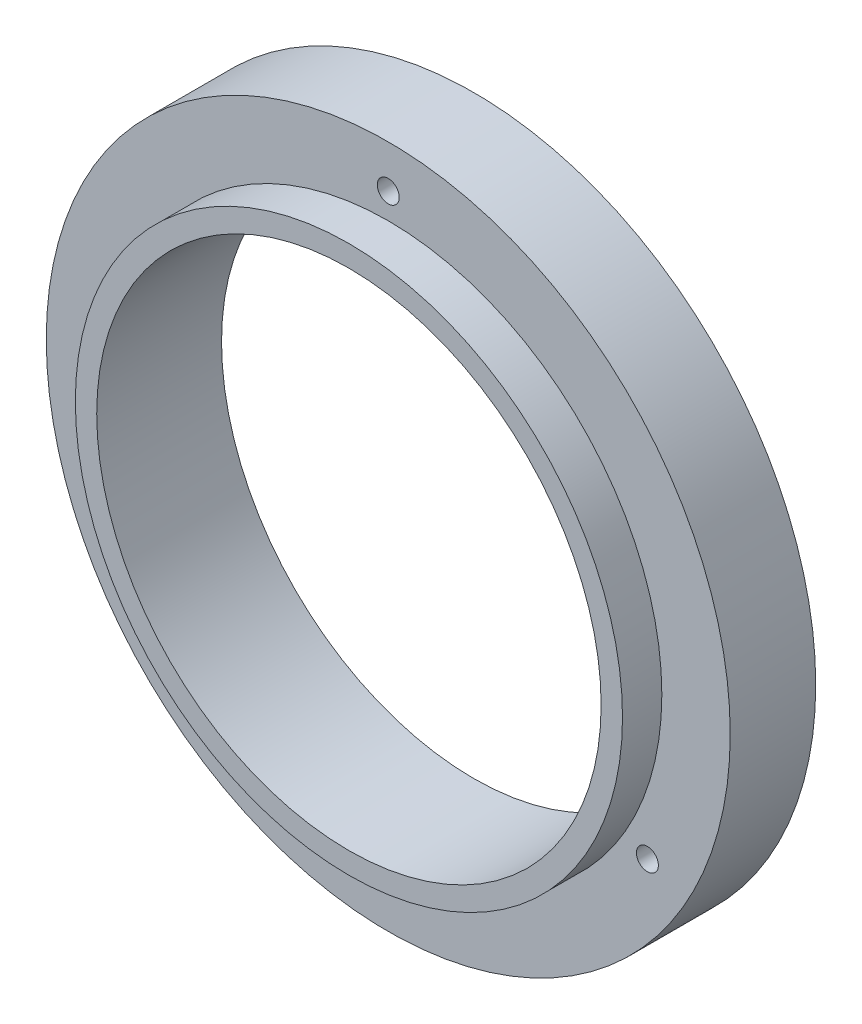
ISO-10303-21;
HEADER;
FILE_DESCRIPTION(('STEP AP214'),'2;1');
FILE_NAME('part.step','',(''),(''),'','','');
FILE_SCHEMA(('AUTOMOTIVE_DESIGN { 1 0 10303 214 1 1 1 1 }'));
ENDSEC;
DATA;
#1=APPLICATION_CONTEXT('core data for automotive mechanical design processes');
#2=APPLICATION_PROTOCOL_DEFINITION('international standard','automotive_design',2000,#1);
#3=PRODUCT_CONTEXT('',#1,'mechanical');
#4=PRODUCT('Part','Part','',(#3));
#5=PRODUCT_RELATED_PRODUCT_CATEGORY('part','',(#4));
#6=PRODUCT_DEFINITION_FORMATION('','',#4);
#7=PRODUCT_DEFINITION_CONTEXT('part definition',#1,'design');
#8=PRODUCT_DEFINITION('design','',#6,#7);
#9=PRODUCT_DEFINITION_SHAPE('','',#8);
#10=(LENGTH_UNIT() NAMED_UNIT(*) SI_UNIT(.MILLI.,.METRE.));
#11=(NAMED_UNIT(*) PLANE_ANGLE_UNIT() SI_UNIT($,.RADIAN.));
#12=(NAMED_UNIT(*) SI_UNIT($,.STERADIAN.) SOLID_ANGLE_UNIT());
#13=UNCERTAINTY_MEASURE_WITH_UNIT(LENGTH_MEASURE(1.E-05),#10,'distance_accuracy_value','');
#14=(GEOMETRIC_REPRESENTATION_CONTEXT(3) GLOBAL_UNCERTAINTY_ASSIGNED_CONTEXT((#13)) GLOBAL_UNIT_ASSIGNED_CONTEXT((#10,
#11,#12)) REPRESENTATION_CONTEXT('',''));
#15=CARTESIAN_POINT('',(0.,0.,0.));
#16=DIRECTION('',(0.,0.,1.));
#17=DIRECTION('',(1.,0.,0.));
#18=AXIS2_PLACEMENT_3D('',#15,#16,#17);
#19=CARTESIAN_POINT('',(0.,0.,12.7));
#20=DIRECTION('',(0.,0.,-1.));
#21=DIRECTION('',(-1.,0.,0.));
#22=AXIS2_PLACEMENT_3D('',#19,#20,#21);
#23=CYLINDRICAL_SURFACE('',#22,50.8);
#24=CARTESIAN_POINT('',(0.,0.,12.7));
#25=DIRECTION('',(0.,0.,1.));
#26=DIRECTION('',(1.,0.,0.));
#27=AXIS2_PLACEMENT_3D('',#24,#25,#26);
#28=CIRCLE('',#27,50.8);
#29=CARTESIAN_POINT('',(50.8,0.,12.7));
#30=VERTEX_POINT('',#29);
#31=EDGE_CURVE('E10',#30,#30,#28,.T.);
#32=ORIENTED_EDGE('',*,*,#31,.F.);
#33=EDGE_LOOP('',(#32));
#34=FACE_BOUND('',#33,.T.);
#35=CARTESIAN_POINT('',(0.,0.,0.));
#36=DIRECTION('',(0.,0.,1.));
#37=DIRECTION('',(1.,0.,0.));
#38=AXIS2_PLACEMENT_3D('',#35,#36,#37);
#39=CIRCLE('',#38,50.8);
#40=CARTESIAN_POINT('',(50.8,0.,0.));
#41=VERTEX_POINT('',#40);
#42=EDGE_CURVE('E38',#41,#41,#39,.T.);
#43=ORIENTED_EDGE('',*,*,#42,.T.);
#44=EDGE_LOOP('',(#43));
#45=FACE_BOUND('',#44,.T.);
#46=ADVANCED_FACE('F31',(#34,#45),#23,.T.);
#47=CARTESIAN_POINT('',(0.,0.,12.7));
#48=DIRECTION('',(0.,0.,1.));
#49=DIRECTION('',(1.,0.,0.));
#50=AXIS2_PLACEMENT_3D('',#47,#48,#49);
#51=PLANE('',#50);
#52=CARTESIAN_POINT('',(-38.4948291982185,-22.2249999999996,12.7));
#53=DIRECTION('',(0.,0.,1.));
#54=DIRECTION('',(1.,0.,0.));
#55=AXIS2_PLACEMENT_3D('',#52,#53,#54);
#56=CIRCLE('',#55,1.63195);
#57=CARTESIAN_POINT('',(-36.8628791982185,-22.2249999999996,12.7));
#58=VERTEX_POINT('',#57);
#59=EDGE_CURVE('E34',#58,#58,#56,.T.);
#60=ORIENTED_EDGE('',*,*,#59,.F.);
#61=EDGE_LOOP('',(#60));
#62=FACE_BOUND('',#61,.T.);
#63=CARTESIAN_POINT('',(38.4948291982182,-22.2250000000002,12.7));
#64=DIRECTION('',(0.,0.,1.));
#65=DIRECTION('',(1.,0.,0.));
#66=AXIS2_PLACEMENT_3D('',#63,#64,#65);
#67=CIRCLE('',#66,1.63195);
#68=CARTESIAN_POINT('',(40.1267791982182,-22.2250000000002,12.7));
#69=VERTEX_POINT('',#68);
#70=EDGE_CURVE('E53',#69,#69,#67,.T.);
#71=ORIENTED_EDGE('',*,*,#70,.F.);
#72=EDGE_LOOP('',(#71));
#73=FACE_BOUND('',#72,.T.);
#74=CARTESIAN_POINT('',(0.,44.45,12.7));
#75=DIRECTION('',(0.,0.,1.));
#76=DIRECTION('',(1.,0.,0.));
#77=AXIS2_PLACEMENT_3D('',#74,#75,#76);
#78=CIRCLE('',#77,1.63195);
#79=CARTESIAN_POINT('',(1.63195,44.45,12.7));
#80=VERTEX_POINT('',#79);
#81=EDGE_CURVE('E49',#80,#80,#78,.T.);
#82=ORIENTED_EDGE('',*,*,#81,.F.);
#83=EDGE_LOOP('',(#82));
#84=FACE_BOUND('',#83,.T.);
#85=CARTESIAN_POINT('',(0.,0.,12.7));
#86=DIRECTION('',(0.,0.,1.));
#87=DIRECTION('',(1.,0.,0.));
#88=AXIS2_PLACEMENT_3D('',#85,#86,#87);
#89=CIRCLE('',#88,40.64);
#90=CARTESIAN_POINT('',(40.64,0.,12.7));
#91=VERTEX_POINT('',#90);
#92=EDGE_CURVE('E46',#91,#91,#89,.T.);
#93=ORIENTED_EDGE('',*,*,#92,.F.);
#94=EDGE_LOOP('',(#93));
#95=FACE_BOUND('',#94,.T.);
#96=ORIENTED_EDGE('',*,*,#31,.T.);
#97=EDGE_LOOP('',(#96));
#98=FACE_BOUND('',#97,.T.);
#99=ADVANCED_FACE('F88',(#62,#73,#84,#95,#98),#51,.T.);
#100=CARTESIAN_POINT('',(0.,0.,0.));
#101=DIRECTION('',(0.,0.,1.));
#102=DIRECTION('',(1.,0.,0.));
#103=AXIS2_PLACEMENT_3D('',#100,#101,#102);
#104=PLANE('',#103);
#105=CARTESIAN_POINT('',(-38.4948291982185,-22.2249999999996,0.));
#106=DIRECTION('',(0.,0.,-1.));
#107=DIRECTION('',(-1.,0.,0.));
#108=AXIS2_PLACEMENT_3D('',#105,#106,#107);
#109=CIRCLE('',#108,2.77876);
#110=CARTESIAN_POINT('',(-41.2735891982185,-22.2249999999996,0.));
#111=VERTEX_POINT('',#110);
#112=EDGE_CURVE('E154',#111,#111,#109,.T.);
#113=ORIENTED_EDGE('',*,*,#112,.F.);
#114=EDGE_LOOP('',(#113));
#115=FACE_BOUND('',#114,.T.);
#116=CARTESIAN_POINT('',(38.4948291982182,-22.2250000000002,0.));
#117=DIRECTION('',(0.,0.,-1.));
#118=DIRECTION('',(-1.,0.,0.));
#119=AXIS2_PLACEMENT_3D('',#116,#117,#118);
#120=CIRCLE('',#119,2.77876);
#121=CARTESIAN_POINT('',(35.7160691982182,-22.2250000000002,0.));
#122=VERTEX_POINT('',#121);
#123=EDGE_CURVE('E68',#122,#122,#120,.T.);
#124=ORIENTED_EDGE('',*,*,#123,.F.);
#125=EDGE_LOOP('',(#124));
#126=FACE_BOUND('',#125,.T.);
#127=CARTESIAN_POINT('',(0.,44.45,0.));
#128=DIRECTION('',(0.,0.,-1.));
#129=DIRECTION('',(-1.,0.,0.));
#130=AXIS2_PLACEMENT_3D('',#127,#128,#129);
#131=CIRCLE('',#130,2.77876);
#132=CARTESIAN_POINT('',(-2.77876,44.45,0.));
#133=VERTEX_POINT('',#132);
#134=EDGE_CURVE('E55',#133,#133,#131,.T.);
#135=ORIENTED_EDGE('',*,*,#134,.F.);
#136=EDGE_LOOP('',(#135));
#137=FACE_BOUND('',#136,.T.);
#138=CARTESIAN_POINT('',(0.,0.,0.));
#139=DIRECTION('',(0.,0.,1.));
#140=DIRECTION('',(1.,0.,0.));
#141=AXIS2_PLACEMENT_3D('',#138,#139,#140);
#142=CIRCLE('',#141,37.465);
#143=CARTESIAN_POINT('',(37.465,0.,0.));
#144=VERTEX_POINT('',#143);
#145=EDGE_CURVE('E51',#144,#144,#142,.T.);
#146=ORIENTED_EDGE('',*,*,#145,.T.);
#147=EDGE_LOOP('',(#146));
#148=FACE_BOUND('',#147,.T.);
#149=ORIENTED_EDGE('',*,*,#42,.F.);
#150=EDGE_LOOP('',(#149));
#151=FACE_BOUND('',#150,.T.);
#152=ADVANCED_FACE('F90',(#115,#126,#137,#148,#151),#104,.F.);
#153=CARTESIAN_POINT('',(0.,0.,18.542));
#154=DIRECTION('',(0.,0.,1.));
#155=DIRECTION('',(1.,0.,0.));
#156=AXIS2_PLACEMENT_3D('',#153,#154,#155);
#157=PLANE('',#156);
#158=CARTESIAN_POINT('',(0.,0.,18.542));
#159=DIRECTION('',(0.,0.,1.));
#160=DIRECTION('',(1.,0.,0.));
#161=AXIS2_PLACEMENT_3D('',#158,#159,#160);
#162=CIRCLE('',#161,40.64);
#163=CARTESIAN_POINT('',(40.64,0.,18.542));
#164=VERTEX_POINT('',#163);
#165=EDGE_CURVE('E43',#164,#164,#162,.T.);
#166=ORIENTED_EDGE('',*,*,#165,.T.);
#167=EDGE_LOOP('',(#166));
#168=FACE_BOUND('',#167,.T.);
#169=CARTESIAN_POINT('',(0.,0.,18.542));
#170=DIRECTION('',(0.,0.,1.));
#171=DIRECTION('',(1.,0.,0.));
#172=AXIS2_PLACEMENT_3D('',#169,#170,#171);
#173=CIRCLE('',#172,37.465);
#174=CARTESIAN_POINT('',(37.465,0.,18.542));
#175=VERTEX_POINT('',#174);
#176=EDGE_CURVE('E78',#175,#175,#173,.T.);
#177=ORIENTED_EDGE('',*,*,#176,.F.);
#178=EDGE_LOOP('',(#177));
#179=FACE_BOUND('',#178,.T.);
#180=ADVANCED_FACE('F97',(#168,#179),#157,.T.);
#181=CARTESIAN_POINT('',(0.,0.,18.542));
#182=DIRECTION('',(0.,0.,-1.));
#183=DIRECTION('',(-1.,0.,0.));
#184=AXIS2_PLACEMENT_3D('',#181,#182,#183);
#185=CYLINDRICAL_SURFACE('',#184,40.64);
#186=ORIENTED_EDGE('',*,*,#165,.F.);
#187=EDGE_LOOP('',(#186));
#188=FACE_BOUND('',#187,.T.);
#189=ORIENTED_EDGE('',*,*,#92,.T.);
#190=EDGE_LOOP('',(#189));
#191=FACE_BOUND('',#190,.T.);
#192=ADVANCED_FACE('F86',(#188,#191),#185,.T.);
#193=CARTESIAN_POINT('',(0.,0.,18.542));
#194=DIRECTION('',(0.,0.,-1.));
#195=DIRECTION('',(-1.,0.,0.));
#196=AXIS2_PLACEMENT_3D('',#193,#194,#195);
#197=CYLINDRICAL_SURFACE('',#196,37.465);
#198=ORIENTED_EDGE('',*,*,#176,.T.);
#199=EDGE_LOOP('',(#198));
#200=FACE_BOUND('',#199,.T.);
#201=ORIENTED_EDGE('',*,*,#145,.F.);
#202=EDGE_LOOP('',(#201));
#203=FACE_BOUND('',#202,.T.);
#204=ADVANCED_FACE('F105',(#200,#203),#197,.F.);
#205=CARTESIAN_POINT('',(0.,44.45,0.));
#206=DIRECTION('',(0.,0.,-1.));
#207=DIRECTION('',(-1.,0.,0.));
#208=AXIS2_PLACEMENT_3D('',#205,#206,#207);
#209=CYLINDRICAL_SURFACE('',#208,1.63195);
#210=ORIENTED_EDGE('',*,*,#81,.T.);
#211=EDGE_LOOP('',(#210));
#212=FACE_BOUND('',#211,.T.);
#213=CARTESIAN_POINT('',(0.,44.45,2.8448));
#214=DIRECTION('',(0.,0.,-1.));
#215=DIRECTION('',(-1.,0.,0.));
#216=AXIS2_PLACEMENT_3D('',#213,#214,#215);
#217=CIRCLE('',#216,1.63195);
#218=CARTESIAN_POINT('',(-1.63195,44.45,2.8448));
#219=VERTEX_POINT('',#218);
#220=EDGE_CURVE('E52',#219,#219,#217,.T.);
#221=ORIENTED_EDGE('',*,*,#220,.T.);
#222=EDGE_LOOP('',(#221));
#223=FACE_BOUND('',#222,.T.);
#224=ADVANCED_FACE('F111',(#212,#223),#209,.F.);
#225=CARTESIAN_POINT('',(1.63195,44.45,2.8448));
#226=DIRECTION('',(0.,0.,1.));
#227=DIRECTION('',(1.,0.,0.));
#228=AXIS2_PLACEMENT_3D('',#225,#226,#227);
#229=PLANE('',#228);
#230=ORIENTED_EDGE('',*,*,#220,.F.);
#231=EDGE_LOOP('',(#230));
#232=FACE_BOUND('',#231,.T.);
#233=CARTESIAN_POINT('',(0.,44.45,2.8448));
#234=DIRECTION('',(0.,0.,-1.));
#235=DIRECTION('',(-1.,0.,0.));
#236=AXIS2_PLACEMENT_3D('',#233,#234,#235);
#237=CIRCLE('',#236,2.77876);
#238=CARTESIAN_POINT('',(-2.77876,44.45,2.8448));
#239=VERTEX_POINT('',#238);
#240=EDGE_CURVE('E60',#239,#239,#237,.T.);
#241=ORIENTED_EDGE('',*,*,#240,.T.);
#242=EDGE_LOOP('',(#241));
#243=FACE_BOUND('',#242,.T.);
#244=ADVANCED_FACE('F115',(#232,#243),#229,.F.);
#245=CARTESIAN_POINT('',(0.,44.45,0.));
#246=DIRECTION('',(0.,0.,-1.));
#247=DIRECTION('',(-1.,0.,0.));
#248=AXIS2_PLACEMENT_3D('',#245,#246,#247);
#249=CYLINDRICAL_SURFACE('',#248,2.77876);
#250=ORIENTED_EDGE('',*,*,#240,.F.);
#251=EDGE_LOOP('',(#250));
#252=FACE_BOUND('',#251,.T.);
#253=ORIENTED_EDGE('',*,*,#134,.T.);
#254=EDGE_LOOP('',(#253));
#255=FACE_BOUND('',#254,.T.);
#256=ADVANCED_FACE('F119',(#252,#255),#249,.F.);
#257=CARTESIAN_POINT('',(38.4948291982182,-22.2250000000002,0.));
#258=DIRECTION('',(0.,0.,-1.));
#259=DIRECTION('',(-1.,0.,0.));
#260=AXIS2_PLACEMENT_3D('',#257,#258,#259);
#261=CYLINDRICAL_SURFACE('',#260,1.63195);
#262=ORIENTED_EDGE('',*,*,#70,.T.);
#263=EDGE_LOOP('',(#262));
#264=FACE_BOUND('',#263,.T.);
#265=CARTESIAN_POINT('',(38.4948291982182,-22.2250000000002,2.8448));
#266=DIRECTION('',(0.,0.,-1.));
#267=DIRECTION('',(-1.,0.,0.));
#268=AXIS2_PLACEMENT_3D('',#265,#266,#267);
#269=CIRCLE('',#268,1.63195);
#270=CARTESIAN_POINT('',(36.8628791982182,-22.2250000000002,2.8448));
#271=VERTEX_POINT('',#270);
#272=EDGE_CURVE('E56',#271,#271,#269,.T.);
#273=ORIENTED_EDGE('',*,*,#272,.T.);
#274=EDGE_LOOP('',(#273));
#275=FACE_BOUND('',#274,.T.);
#276=ADVANCED_FACE('F123',(#264,#275),#261,.F.);
#277=CARTESIAN_POINT('',(40.1267791982182,-22.2250000000002,2.8448));
#278=DIRECTION('',(0.,0.,1.));
#279=DIRECTION('',(1.,0.,0.));
#280=AXIS2_PLACEMENT_3D('',#277,#278,#279);
#281=PLANE('',#280);
#282=ORIENTED_EDGE('',*,*,#272,.F.);
#283=EDGE_LOOP('',(#282));
#284=FACE_BOUND('',#283,.T.);
#285=CARTESIAN_POINT('',(38.4948291982182,-22.2250000000002,2.8448));
#286=DIRECTION('',(0.,0.,-1.));
#287=DIRECTION('',(-1.,0.,0.));
#288=AXIS2_PLACEMENT_3D('',#285,#286,#287);
#289=CIRCLE('',#288,2.77876);
#290=CARTESIAN_POINT('',(35.7160691982182,-22.2250000000002,2.8448));
#291=VERTEX_POINT('',#290);
#292=EDGE_CURVE('E63',#291,#291,#289,.T.);
#293=ORIENTED_EDGE('',*,*,#292,.T.);
#294=EDGE_LOOP('',(#293));
#295=FACE_BOUND('',#294,.T.);
#296=ADVANCED_FACE('F127',(#284,#295),#281,.F.);
#297=CARTESIAN_POINT('',(38.4948291982182,-22.2250000000002,0.));
#298=DIRECTION('',(0.,0.,-1.));
#299=DIRECTION('',(-1.,0.,0.));
#300=AXIS2_PLACEMENT_3D('',#297,#298,#299);
#301=CYLINDRICAL_SURFACE('',#300,2.77876);
#302=ORIENTED_EDGE('',*,*,#292,.F.);
#303=EDGE_LOOP('',(#302));
#304=FACE_BOUND('',#303,.T.);
#305=ORIENTED_EDGE('',*,*,#123,.T.);
#306=EDGE_LOOP('',(#305));
#307=FACE_BOUND('',#306,.T.);
#308=ADVANCED_FACE('F130',(#304,#307),#301,.F.);
#309=CARTESIAN_POINT('',(-38.4948291982185,-22.2249999999996,0.));
#310=DIRECTION('',(0.,0.,-1.));
#311=DIRECTION('',(-1.,0.,0.));
#312=AXIS2_PLACEMENT_3D('',#309,#310,#311);
#313=CYLINDRICAL_SURFACE('',#312,1.63195);
#314=ORIENTED_EDGE('',*,*,#59,.T.);
#315=EDGE_LOOP('',(#314));
#316=FACE_BOUND('',#315,.T.);
#317=CARTESIAN_POINT('',(-38.4948291982185,-22.2249999999996,2.8448));
#318=DIRECTION('',(0.,0.,-1.));
#319=DIRECTION('',(-1.,0.,0.));
#320=AXIS2_PLACEMENT_3D('',#317,#318,#319);
#321=CIRCLE('',#320,1.63195);
#322=CARTESIAN_POINT('',(-40.1267791982185,-22.2249999999996,2.8448));
#323=VERTEX_POINT('',#322);
#324=EDGE_CURVE('E156',#323,#323,#321,.T.);
#325=ORIENTED_EDGE('',*,*,#324,.T.);
#326=EDGE_LOOP('',(#325));
#327=FACE_BOUND('',#326,.T.);
#328=ADVANCED_FACE('F134',(#316,#327),#313,.F.);
#329=CARTESIAN_POINT('',(-36.8628791982185,-22.2249999999996,2.8448));
#330=DIRECTION('',(0.,0.,1.));
#331=DIRECTION('',(1.,0.,0.));
#332=AXIS2_PLACEMENT_3D('',#329,#330,#331);
#333=PLANE('',#332);
#334=ORIENTED_EDGE('',*,*,#324,.F.);
#335=EDGE_LOOP('',(#334));
#336=FACE_BOUND('',#335,.T.);
#337=CARTESIAN_POINT('',(-38.4948291982185,-22.2249999999996,2.8448));
#338=DIRECTION('',(0.,0.,-1.));
#339=DIRECTION('',(-1.,0.,0.));
#340=AXIS2_PLACEMENT_3D('',#337,#338,#339);
#341=CIRCLE('',#340,2.77876);
#342=CARTESIAN_POINT('',(-41.2735891982185,-22.2249999999996,2.8448));
#343=VERTEX_POINT('',#342);
#344=EDGE_CURVE('E151',#343,#343,#341,.T.);
#345=ORIENTED_EDGE('',*,*,#344,.T.);
#346=EDGE_LOOP('',(#345));
#347=FACE_BOUND('',#346,.T.);
#348=ADVANCED_FACE('F138',(#336,#347),#333,.F.);
#349=CARTESIAN_POINT('',(-38.4948291982185,-22.2249999999996,0.));
#350=DIRECTION('',(0.,0.,-1.));
#351=DIRECTION('',(-1.,0.,0.));
#352=AXIS2_PLACEMENT_3D('',#349,#350,#351);
#353=CYLINDRICAL_SURFACE('',#352,2.77876);
#354=ORIENTED_EDGE('',*,*,#344,.F.);
#355=EDGE_LOOP('',(#354));
#356=FACE_BOUND('',#355,.T.);
#357=ORIENTED_EDGE('',*,*,#112,.T.);
#358=EDGE_LOOP('',(#357));
#359=FACE_BOUND('',#358,.T.);
#360=ADVANCED_FACE('F142',(#356,#359),#353,.F.);
#361=CLOSED_SHELL('',(#46,#99,#152,#180,#192,#204,#224,#244,#256,#276,#296,#308,#328,#348,#360));
#362=MANIFOLD_SOLID_BREP('B2',#361);
#363=ADVANCED_BREP_SHAPE_REPRESENTATION('',(#18,#362),#14);
#364=SHAPE_DEFINITION_REPRESENTATION(#9,#363);
ENDSEC;
END-ISO-10303-21;
